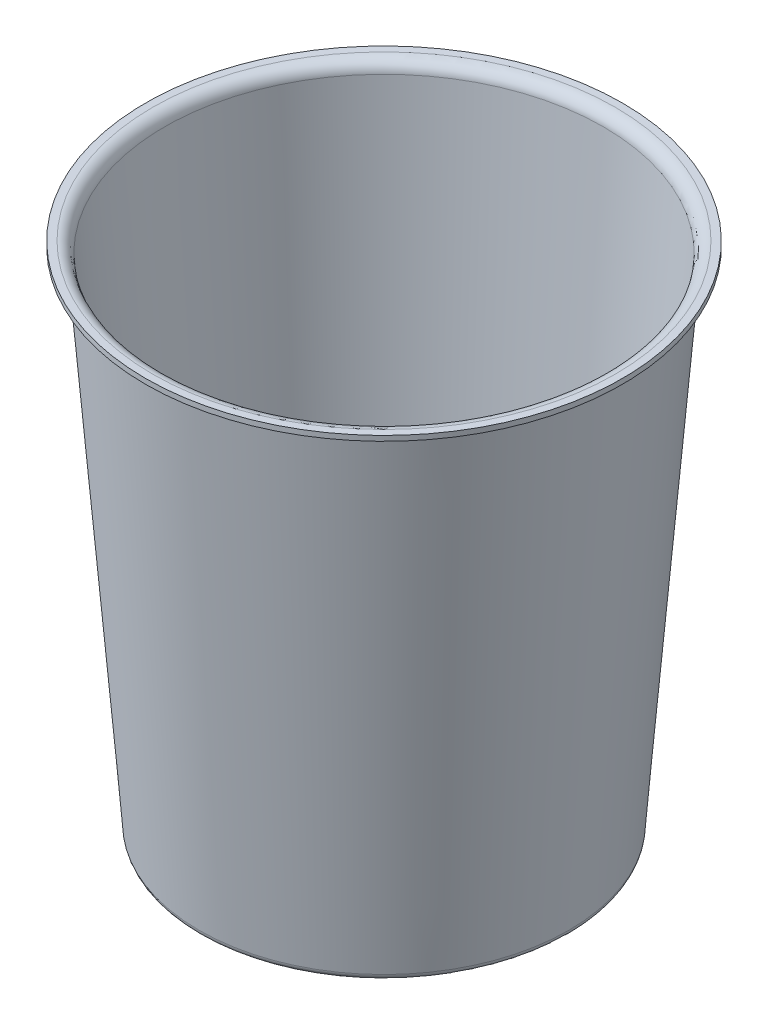
ISO-10303-21;
HEADER;
FILE_DESCRIPTION(('STEP AP214'),'2;1');
FILE_NAME('part.step','',(''),(''),'','','');
FILE_SCHEMA(('AUTOMOTIVE_DESIGN { 1 0 10303 214 1 1 1 1 }'));
ENDSEC;
DATA;
#1=APPLICATION_CONTEXT('core data for automotive mechanical design processes');
#2=APPLICATION_PROTOCOL_DEFINITION('international standard','automotive_design',2000,#1);
#3=PRODUCT_CONTEXT('',#1,'mechanical');
#4=PRODUCT('Part','Part','',(#3));
#5=PRODUCT_RELATED_PRODUCT_CATEGORY('part','',(#4));
#6=PRODUCT_DEFINITION_FORMATION('','',#4);
#7=PRODUCT_DEFINITION_CONTEXT('part definition',#1,'design');
#8=PRODUCT_DEFINITION('design','',#6,#7);
#9=PRODUCT_DEFINITION_SHAPE('','',#8);
#10=(LENGTH_UNIT() NAMED_UNIT(*) SI_UNIT(.MILLI.,.METRE.));
#11=(NAMED_UNIT(*) PLANE_ANGLE_UNIT() SI_UNIT($,.RADIAN.));
#12=(NAMED_UNIT(*) SI_UNIT($,.STERADIAN.) SOLID_ANGLE_UNIT());
#13=UNCERTAINTY_MEASURE_WITH_UNIT(LENGTH_MEASURE(1.E-05),#10,'distance_accuracy_value','');
#14=(GEOMETRIC_REPRESENTATION_CONTEXT(3) GLOBAL_UNCERTAINTY_ASSIGNED_CONTEXT((#13)) GLOBAL_UNIT_ASSIGNED_CONTEXT((#10,
#11,#12)) REPRESENTATION_CONTEXT('',''));
#15=CARTESIAN_POINT('',(0.,0.,0.));
#16=DIRECTION('',(0.,0.,1.));
#17=DIRECTION('',(1.,0.,0.));
#18=AXIS2_PLACEMENT_3D('',#15,#16,#17);
#19=CARTESIAN_POINT('',(0.,300.,0.));
#20=DIRECTION('',(0.,-1.,0.));
#21=DIRECTION('',(0.,0.,-1.));
#22=AXIS2_PLACEMENT_3D('',#19,#20,#21);
#23=CYLINDRICAL_SURFACE('',#22,140.);
#24=CARTESIAN_POINT('',(0.,300.,0.));
#25=DIRECTION('',(0.,1.,0.));
#26=DIRECTION('',(0.,0.,1.));
#27=AXIS2_PLACEMENT_3D('',#24,#25,#26);
#28=CIRCLE('',#27,140.);
#29=CARTESIAN_POINT('',(0.,300.,140.));
#30=VERTEX_POINT('',#29);
#31=EDGE_CURVE('E41',#30,#30,#28,.T.);
#32=ORIENTED_EDGE('',*,*,#31,.F.);
#33=EDGE_LOOP('',(#32));
#34=FACE_BOUND('',#33,.T.);
#35=CARTESIAN_POINT('',(0.,297.,0.));
#36=DIRECTION('',(0.,-1.,0.));
#37=DIRECTION('',(0.,0.,-1.));
#38=AXIS2_PLACEMENT_3D('',#35,#36,#37);
#39=CIRCLE('',#38,140.);
#40=CARTESIAN_POINT('',(0.,297.,-140.));
#41=VERTEX_POINT('',#40);
#42=EDGE_CURVE('E45',#41,#41,#39,.T.);
#43=ORIENTED_EDGE('',*,*,#42,.F.);
#44=EDGE_LOOP('',(#43));
#45=FACE_BOUND('',#44,.T.);
#46=ADVANCED_FACE('F30',(#34,#45),#23,.T.);
#47=CARTESIAN_POINT('',(0.,300.,0.));
#48=DIRECTION('',(0.,1.,0.));
#49=DIRECTION('',(0.,0.,1.));
#50=AXIS2_PLACEMENT_3D('',#47,#48,#49);
#51=PLANE('',#50);
#52=CARTESIAN_POINT('',(0.,300.,0.));
#53=DIRECTION('',(0.,-1.,0.));
#54=DIRECTION('',(0.,0.,-1.));
#55=AXIS2_PLACEMENT_3D('',#52,#53,#54);
#56=CIRCLE('',#55,135.724042480262);
#57=CARTESIAN_POINT('',(0.,300.,-135.724042480262));
#58=VERTEX_POINT('',#57);
#59=EDGE_CURVE('E65',#58,#58,#56,.T.);
#60=ORIENTED_EDGE('',*,*,#59,.T.);
#61=EDGE_LOOP('',(#60));
#62=FACE_BOUND('',#61,.T.);
#63=ORIENTED_EDGE('',*,*,#31,.T.);
#64=EDGE_LOOP('',(#63));
#65=FACE_BOUND('',#64,.T.);
#66=ADVANCED_FACE('F69',(#62,#65),#51,.T.);
#67=CARTESIAN_POINT('',(-135.724042480262,297.,0.));
#68=DIRECTION('',(0.,-1.,0.));
#69=DIRECTION('',(0.,0.,-1.));
#70=AXIS2_PLACEMENT_3D('',#67,#68,#69);
#71=PLANE('',#70);
#72=CARTESIAN_POINT('',(0.,297.,0.));
#73=DIRECTION('',(0.,-1.,0.));
#74=DIRECTION('',(0.,0.,-1.));
#75=AXIS2_PLACEMENT_3D('',#72,#73,#74);
#76=CIRCLE('',#75,135.724042480262);
#77=CARTESIAN_POINT('',(0.,297.,-135.724042480262));
#78=VERTEX_POINT('',#77);
#79=EDGE_CURVE('E53',#78,#78,#76,.T.);
#80=ORIENTED_EDGE('',*,*,#79,.F.);
#81=EDGE_LOOP('',(#80));
#82=FACE_BOUND('',#81,.T.);
#83=ORIENTED_EDGE('',*,*,#42,.T.);
#84=EDGE_LOOP('',(#83));
#85=FACE_BOUND('',#84,.T.);
#86=ADVANCED_FACE('F94',(#82,#85),#71,.T.);
#87=CARTESIAN_POINT('',(0.,-4.32105868814738,0.));
#88=DIRECTION('',(0.,1.,0.));
#89=DIRECTION('',(0.,0.,1.));
#90=AXIS2_PLACEMENT_3D('',#87,#88,#89);
#91=CONICAL_SURFACE('',#90,107.848101265823,0.0800886286929343);
#92=CARTESIAN_POINT('',(0.,3.67998784444986,0.));
#93=DIRECTION('',(0.,1.,0.));
#94=DIRECTION('',(0.,0.,1.));
#95=AXIS2_PLACEMENT_3D('',#92,#93,#94);
#96=CIRCLE('',#95,108.490267690348);
#97=CARTESIAN_POINT('',(0.,3.67998784444986,108.490267690348));
#98=VERTEX_POINT('',#97);
#99=EDGE_CURVE('E37',#98,#98,#96,.T.);
#100=ORIENTED_EDGE('',*,*,#99,.T.);
#101=EDGE_LOOP('',(#100));
#102=FACE_BOUND('',#101,.T.);
#103=CARTESIAN_POINT('',(0.,293.32001215555,0.));
#104=DIRECTION('',(0.,-1.,0.));
#105=DIRECTION('',(0.,0.,-1.));
#106=AXIS2_PLACEMENT_3D('',#103,#104,#105);
#107=CIRCLE('',#106,131.736864001651);
#108=CARTESIAN_POINT('',(0.,293.32001215555,-131.736864001651));
#109=VERTEX_POINT('',#108);
#110=EDGE_CURVE('E49',#109,#109,#107,.T.);
#111=ORIENTED_EDGE('',*,*,#110,.T.);
#112=EDGE_LOOP('',(#111));
#113=FACE_BOUND('',#112,.T.);
#114=ADVANCED_FACE('F102',(#102,#113),#91,.T.);
#115=CARTESIAN_POINT('',(0.,293.,0.));
#116=DIRECTION('',(0.,-1.,0.));
#117=DIRECTION('',(0.,0.,-1.));
#118=AXIS2_PLACEMENT_3D('',#115,#116,#117);
#119=TOROIDAL_SURFACE('',#118,135.724042480262,4.);
#120=ORIENTED_EDGE('',*,*,#79,.T.);
#121=EDGE_LOOP('',(#120));
#122=FACE_BOUND('',#121,.T.);
#123=ORIENTED_EDGE('',*,*,#110,.F.);
#124=EDGE_LOOP('',(#123));
#125=FACE_BOUND('',#124,.T.);
#126=ADVANCED_FACE('F100',(#122,#125),#119,.F.);
#127=CARTESIAN_POINT('',(0.,0.,0.));
#128=DIRECTION('',(0.,1.,0.));
#129=DIRECTION('',(0.,0.,1.));
#130=AXIS2_PLACEMENT_3D('',#127,#128,#129);
#131=PLANE('',#130);
#132=CARTESIAN_POINT('',(0.,0.,0.));
#133=DIRECTION('',(0.,1.,0.));
#134=DIRECTION('',(0.,0.,1.));
#135=AXIS2_PLACEMENT_3D('',#132,#133,#134);
#136=CIRCLE('',#135,104.503089211737);
#137=CARTESIAN_POINT('',(0.,0.,104.503089211737));
#138=VERTEX_POINT('',#137);
#139=EDGE_CURVE('E10',#138,#138,#136,.F.);
#140=ORIENTED_EDGE('',*,*,#139,.T.);
#141=EDGE_LOOP('',(#140));
#142=FACE_BOUND('',#141,.T.);
#143=ADVANCED_FACE('F86',(#142),#131,.F.);
#144=CARTESIAN_POINT('',(0.,4.,0.));
#145=DIRECTION('',(0.,1.,0.));
#146=DIRECTION('',(0.,0.,1.));
#147=AXIS2_PLACEMENT_3D('',#144,#145,#146);
#148=TOROIDAL_SURFACE('',#147,104.503089211737,4.);
#149=ORIENTED_EDGE('',*,*,#139,.F.);
#150=EDGE_LOOP('',(#149));
#151=FACE_BOUND('',#150,.T.);
#152=ORIENTED_EDGE('',*,*,#99,.F.);
#153=EDGE_LOOP('',(#152));
#154=FACE_BOUND('',#153,.T.);
#155=ADVANCED_FACE('F32',(#151,#154),#148,.T.);
#156=CARTESIAN_POINT('',(0.,-4.08104957148478,0.));
#157=DIRECTION('',(0.,1.,0.));
#158=DIRECTION('',(0.,0.,1.));
#159=AXIS2_PLACEMENT_3D('',#156,#157,#158);
#160=CONICAL_SURFACE('',#159,104.857717406864,0.0800886286929343);
#161=CARTESIAN_POINT('',(0.,3.91999696111247,0.));
#162=DIRECTION('',(0.,1.,0.));
#163=DIRECTION('',(0.,0.,1.));
#164=AXIS2_PLACEMENT_3D('',#161,#162,#163);
#165=CIRCLE('',#164,105.49988383139);
#166=CARTESIAN_POINT('',(0.,3.91999696111247,105.49988383139));
#167=VERTEX_POINT('',#166);
#168=EDGE_CURVE('E59',#167,#167,#165,.T.);
#169=ORIENTED_EDGE('',*,*,#168,.F.);
#170=EDGE_LOOP('',(#169));
#171=FACE_BOUND('',#170,.T.);
#172=CARTESIAN_POINT('',(0.,293.560021272213,0.));
#173=DIRECTION('',(0.,1.,0.));
#174=DIRECTION('',(0.,0.,1.));
#175=AXIS2_PLACEMENT_3D('',#172,#173,#174);
#176=CIRCLE('',#175,128.746480142693);
#177=CARTESIAN_POINT('',(0.,293.560021272213,128.746480142693));
#178=VERTEX_POINT('',#177);
#179=EDGE_CURVE('E62',#178,#178,#176,.F.);
#180=ORIENTED_EDGE('',*,*,#179,.F.);
#181=EDGE_LOOP('',(#180));
#182=FACE_BOUND('',#181,.T.);
#183=ADVANCED_FACE('F76',(#171,#182),#160,.F.);
#184=CARTESIAN_POINT('',(0.,293.,0.));
#185=DIRECTION('',(0.,-1.,0.));
#186=DIRECTION('',(0.,0.,-1.));
#187=AXIS2_PLACEMENT_3D('',#184,#185,#186);
#188=TOROIDAL_SURFACE('',#187,135.724042480262,7.);
#189=ORIENTED_EDGE('',*,*,#59,.F.);
#190=EDGE_LOOP('',(#189));
#191=FACE_BOUND('',#190,.T.);
#192=ORIENTED_EDGE('',*,*,#179,.T.);
#193=EDGE_LOOP('',(#192));
#194=FACE_BOUND('',#193,.T.);
#195=ADVANCED_FACE('F72',(#191,#194),#188,.T.);
#196=CARTESIAN_POINT('',(0.,3.,0.));
#197=DIRECTION('',(0.,1.,0.));
#198=DIRECTION('',(0.,0.,1.));
#199=AXIS2_PLACEMENT_3D('',#196,#197,#198);
#200=PLANE('',#199);
#201=CARTESIAN_POINT('',(0.,3.,0.));
#202=DIRECTION('',(0.,1.,0.));
#203=DIRECTION('',(0.,0.,1.));
#204=AXIS2_PLACEMENT_3D('',#201,#202,#203);
#205=CIRCLE('',#204,104.503089211737);
#206=CARTESIAN_POINT('',(0.,3.,104.503089211737));
#207=VERTEX_POINT('',#206);
#208=EDGE_CURVE('E56',#207,#207,#205,.F.);
#209=ORIENTED_EDGE('',*,*,#208,.F.);
#210=EDGE_LOOP('',(#209));
#211=FACE_BOUND('',#210,.T.);
#212=ADVANCED_FACE('F75',(#211),#200,.T.);
#213=CARTESIAN_POINT('',(0.,4.,0.));
#214=DIRECTION('',(0.,1.,0.));
#215=DIRECTION('',(0.,0.,1.));
#216=AXIS2_PLACEMENT_3D('',#213,#214,#215);
#217=TOROIDAL_SURFACE('',#216,104.503089211737,1.);
#218=ORIENTED_EDGE('',*,*,#208,.T.);
#219=EDGE_LOOP('',(#218));
#220=FACE_BOUND('',#219,.T.);
#221=ORIENTED_EDGE('',*,*,#168,.T.);
#222=EDGE_LOOP('',(#221));
#223=FACE_BOUND('',#222,.T.);
#224=ADVANCED_FACE('F111',(#220,#223),#217,.F.);
#225=CLOSED_SHELL('',(#46,#66,#86,#114,#126,#143,#155,#183,#195,#212,#224));
#226=MANIFOLD_SOLID_BREP('B2',#225);
#227=ADVANCED_BREP_SHAPE_REPRESENTATION('',(#18,#226),#14);
#228=SHAPE_DEFINITION_REPRESENTATION(#9,#227);
ENDSEC;
END-ISO-10303-21;
